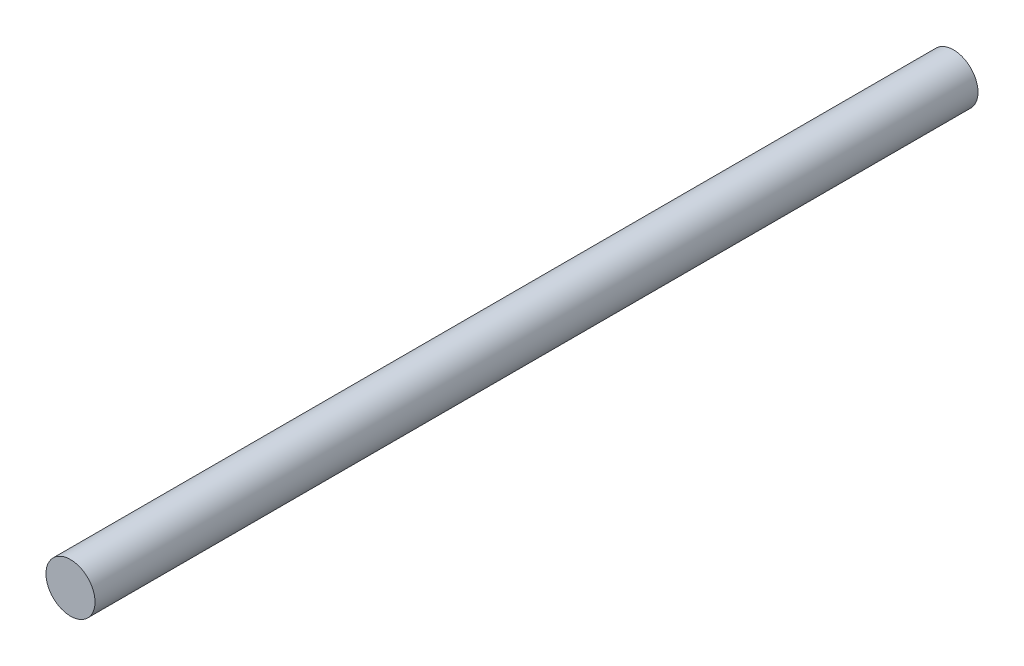
ISO-10303-21;
HEADER;
FILE_DESCRIPTION(('STEP AP214'),'2;1');
FILE_NAME('part.step','',(''),(''),'','','');
FILE_SCHEMA(('AUTOMOTIVE_DESIGN { 1 0 10303 214 1 1 1 1 }'));
ENDSEC;
DATA;
#1=APPLICATION_CONTEXT('core data for automotive mechanical design processes');
#2=APPLICATION_PROTOCOL_DEFINITION('international standard','automotive_design',2000,#1);
#3=PRODUCT_CONTEXT('',#1,'mechanical');
#4=PRODUCT('Part','Part','',(#3));
#5=PRODUCT_RELATED_PRODUCT_CATEGORY('part','',(#4));
#6=PRODUCT_DEFINITION_FORMATION('','',#4);
#7=PRODUCT_DEFINITION_CONTEXT('part definition',#1,'design');
#8=PRODUCT_DEFINITION('design','',#6,#7);
#9=PRODUCT_DEFINITION_SHAPE('','',#8);
#10=(LENGTH_UNIT() NAMED_UNIT(*) SI_UNIT(.MILLI.,.METRE.));
#11=(NAMED_UNIT(*) PLANE_ANGLE_UNIT() SI_UNIT($,.RADIAN.));
#12=(NAMED_UNIT(*) SI_UNIT($,.STERADIAN.) SOLID_ANGLE_UNIT());
#13=UNCERTAINTY_MEASURE_WITH_UNIT(LENGTH_MEASURE(1.E-05),#10,'distance_accuracy_value','');
#14=(GEOMETRIC_REPRESENTATION_CONTEXT(3) GLOBAL_UNCERTAINTY_ASSIGNED_CONTEXT((#13)) GLOBAL_UNIT_ASSIGNED_CONTEXT((#10,
#11,#12)) REPRESENTATION_CONTEXT('',''));
#15=CARTESIAN_POINT('',(0.,0.,0.));
#16=DIRECTION('',(0.,0.,1.));
#17=DIRECTION('',(1.,0.,0.));
#18=AXIS2_PLACEMENT_3D('',#15,#16,#17);
#19=CARTESIAN_POINT('',(0.,0.,57.15));
#20=DIRECTION('',(0.,0.,-1.));
#21=DIRECTION('',(-1.,0.,0.));
#22=AXIS2_PLACEMENT_3D('',#19,#20,#21);
#23=CYLINDRICAL_SURFACE('',#22,3.175);
#24=CARTESIAN_POINT('',(0.,0.,57.15));
#25=DIRECTION('',(0.,0.,1.));
#26=DIRECTION('',(1.,0.,0.));
#27=AXIS2_PLACEMENT_3D('',#24,#25,#26);
#28=CIRCLE('',#27,3.175);
#29=CARTESIAN_POINT('',(3.175,0.,57.15));
#30=VERTEX_POINT('',#29);
#31=EDGE_CURVE('E10',#30,#30,#28,.T.);
#32=ORIENTED_EDGE('',*,*,#31,.F.);
#33=EDGE_LOOP('',(#32));
#34=FACE_BOUND('',#33,.T.);
#35=CARTESIAN_POINT('',(0.,0.,-57.15));
#36=DIRECTION('',(0.,0.,1.));
#37=DIRECTION('',(1.,0.,0.));
#38=AXIS2_PLACEMENT_3D('',#35,#36,#37);
#39=CIRCLE('',#38,3.175);
#40=CARTESIAN_POINT('',(3.175,0.,-57.15));
#41=VERTEX_POINT('',#40);
#42=EDGE_CURVE('E32',#41,#41,#39,.T.);
#43=ORIENTED_EDGE('',*,*,#42,.T.);
#44=EDGE_LOOP('',(#43));
#45=FACE_BOUND('',#44,.T.);
#46=ADVANCED_FACE('F29',(#34,#45),#23,.T.);
#47=CARTESIAN_POINT('',(0.,0.,57.15));
#48=DIRECTION('',(0.,0.,1.));
#49=DIRECTION('',(1.,0.,0.));
#50=AXIS2_PLACEMENT_3D('',#47,#48,#49);
#51=PLANE('',#50);
#52=ORIENTED_EDGE('',*,*,#31,.T.);
#53=EDGE_LOOP('',(#52));
#54=FACE_BOUND('',#53,.T.);
#55=ADVANCED_FACE('F44',(#54),#51,.T.);
#56=CARTESIAN_POINT('',(0.,0.,-57.15));
#57=DIRECTION('',(0.,0.,1.));
#58=DIRECTION('',(1.,0.,0.));
#59=AXIS2_PLACEMENT_3D('',#56,#57,#58);
#60=PLANE('',#59);
#61=ORIENTED_EDGE('',*,*,#42,.F.);
#62=EDGE_LOOP('',(#61));
#63=FACE_BOUND('',#62,.T.);
#64=ADVANCED_FACE('F42',(#63),#60,.F.);
#65=CLOSED_SHELL('',(#46,#55,#64));
#66=MANIFOLD_SOLID_BREP('B2',#65);
#67=ADVANCED_BREP_SHAPE_REPRESENTATION('',(#18,#66),#14);
#68=SHAPE_DEFINITION_REPRESENTATION(#9,#67);
ENDSEC;
END-ISO-10303-21;
